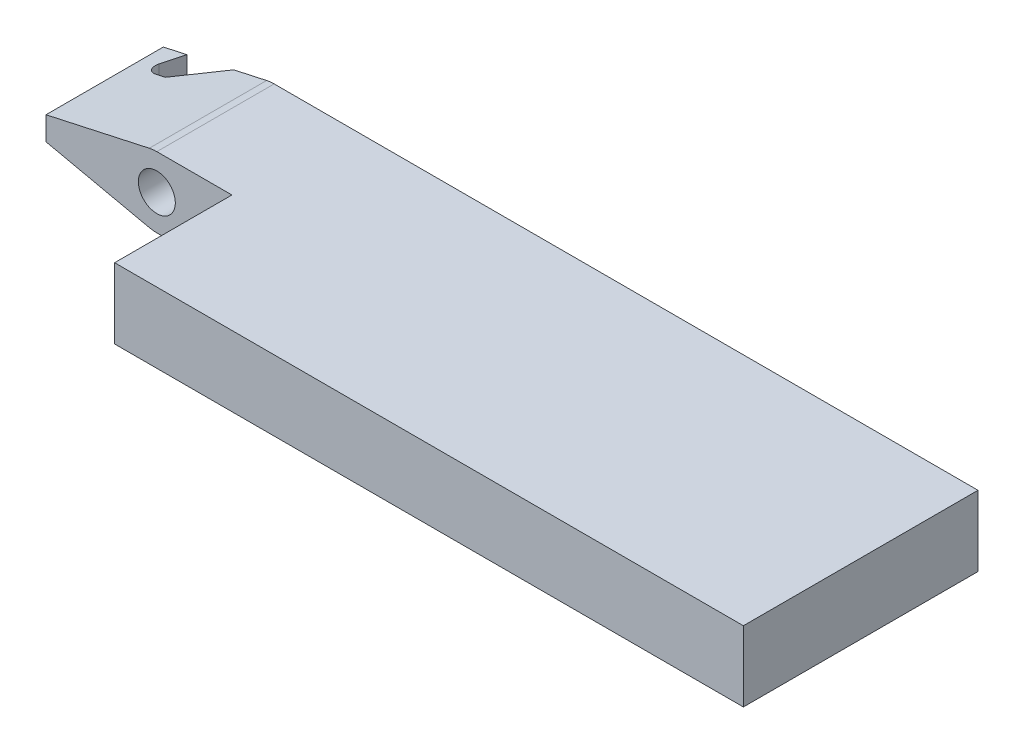
ISO-10303-21;
HEADER;
FILE_DESCRIPTION(('STEP AP214'),'2;1');
FILE_NAME('part.step','',(''),(''),'','','');
FILE_SCHEMA(('AUTOMOTIVE_DESIGN { 1 0 10303 214 1 1 1 1 }'));
ENDSEC;
DATA;
#1=APPLICATION_CONTEXT('core data for automotive mechanical design processes');
#2=APPLICATION_PROTOCOL_DEFINITION('international standard','automotive_design',2000,#1);
#3=PRODUCT_CONTEXT('',#1,'mechanical');
#4=PRODUCT('Part','Part','',(#3));
#5=PRODUCT_RELATED_PRODUCT_CATEGORY('part','',(#4));
#6=PRODUCT_DEFINITION_FORMATION('','',#4);
#7=PRODUCT_DEFINITION_CONTEXT('part definition',#1,'design');
#8=PRODUCT_DEFINITION('design','',#6,#7);
#9=PRODUCT_DEFINITION_SHAPE('','',#8);
#10=(LENGTH_UNIT() NAMED_UNIT(*) SI_UNIT(.MILLI.,.METRE.));
#11=(NAMED_UNIT(*) PLANE_ANGLE_UNIT() SI_UNIT($,.RADIAN.));
#12=(NAMED_UNIT(*) SI_UNIT($,.STERADIAN.) SOLID_ANGLE_UNIT());
#13=UNCERTAINTY_MEASURE_WITH_UNIT(LENGTH_MEASURE(1.E-05),#10,'distance_accuracy_value','');
#14=(GEOMETRIC_REPRESENTATION_CONTEXT(3) GLOBAL_UNCERTAINTY_ASSIGNED_CONTEXT((#13)) GLOBAL_UNIT_ASSIGNED_CONTEXT((#10,
#11,#12)) REPRESENTATION_CONTEXT('',''));
#15=CARTESIAN_POINT('',(0.,0.,0.));
#16=DIRECTION('',(0.,0.,1.));
#17=DIRECTION('',(1.,0.,0.));
#18=AXIS2_PLACEMENT_3D('',#15,#16,#17);
#19=CARTESIAN_POINT('',(0.,3.81,-12.7));
#20=DIRECTION('',(0.,0.,1.));
#21=DIRECTION('',(1.,0.,0.));
#22=AXIS2_PLACEMENT_3D('',#19,#20,#21);
#23=PLANE('',#22);
#24=DIRECTION('',(0.976807089673857,0.214121249676183,0.));
#25=VECTOR('',#24,1.);
#26=CARTESIAN_POINT('',(-0.407900980633129,3.7658175058287,-12.7));
#27=LINE('',#26,#25);
#28=CARTESIAN_POINT('',(-6.,2.54,-12.7));
#29=VERTEX_POINT('',#28);
#30=CARTESIAN_POINT('',(-4.73,2.81839067709833,-12.7));
#31=VERTEX_POINT('',#30);
#32=EDGE_CURVE('E168',#29,#31,#27,.T.);
#33=ORIENTED_EDGE('',*,*,#32,.T.);
#34=DIRECTION('',(0.,-1.,0.));
#35=VECTOR('',#34,1.);
#36=CARTESIAN_POINT('',(-4.73,3.81,-12.7));
#37=LINE('',#36,#35);
#38=CARTESIAN_POINT('',(-4.73,0.991609322901672,-12.7));
#39=VERTEX_POINT('',#38);
#40=EDGE_CURVE('E268',#31,#39,#37,.T.);
#41=ORIENTED_EDGE('',*,*,#40,.T.);
#42=DIRECTION('',(-0.976807089673857,0.214121249676183,0.));
#43=VECTOR('',#42,1.);
#44=CARTESIAN_POINT('',(-6.,1.27,-12.7));
#45=LINE('',#44,#43);
#46=CARTESIAN_POINT('',(-6.,1.27,-12.7));
#47=VERTEX_POINT('',#46);
#48=EDGE_CURVE('E248',#39,#47,#45,.T.);
#49=ORIENTED_EDGE('',*,*,#48,.T.);
#50=DIRECTION('',(0.,1.,0.));
#51=VECTOR('',#50,1.);
#52=CARTESIAN_POINT('',(-6.,2.54,-12.7));
#53=LINE('',#52,#51);
#54=EDGE_CURVE('E169',#47,#29,#53,.T.);
#55=ORIENTED_EDGE('',*,*,#54,.T.);
#56=EDGE_LOOP('',(#33,#41,#49,#55));
#57=FACE_BOUND('',#56,.T.);
#58=ADVANCED_FACE('F34',(#57),#23,.F.);
#59=CARTESIAN_POINT('',(0.,3.81,0.));
#60=DIRECTION('',(0.,0.,-1.));
#61=DIRECTION('',(-1.,0.,0.));
#62=AXIS2_PLACEMENT_3D('',#59,#60,#61);
#63=PLANE('',#62);
#64=DIRECTION('',(1.,0.,0.));
#65=VECTOR('',#64,1.);
#66=CARTESIAN_POINT('',(0.,3.81,0.));
#67=LINE('',#66,#65);
#68=CARTESIAN_POINT('',(4.064,3.81,0.));
#69=VERTEX_POINT('',#68);
#70=CARTESIAN_POINT('',(38.1,3.81,0.));
#71=VERTEX_POINT('',#70);
#72=EDGE_CURVE('E209',#69,#71,#67,.T.);
#73=ORIENTED_EDGE('',*,*,#72,.F.);
#74=DIRECTION('',(0.,1.,0.));
#75=VECTOR('',#74,1.);
#76=CARTESIAN_POINT('',(4.064,0.,0.));
#77=LINE('',#76,#75);
#78=CARTESIAN_POINT('',(4.064,0.,0.));
#79=VERTEX_POINT('',#78);
#80=EDGE_CURVE('E197',#79,#69,#77,.T.);
#81=ORIENTED_EDGE('',*,*,#80,.F.);
#82=DIRECTION('',(1.,0.,0.));
#83=VECTOR('',#82,1.);
#84=CARTESIAN_POINT('',(0.,0.,0.));
#85=LINE('',#84,#83);
#86=CARTESIAN_POINT('',(38.1,0.,0.));
#87=VERTEX_POINT('',#86);
#88=EDGE_CURVE('E220',#79,#87,#85,.T.);
#89=ORIENTED_EDGE('',*,*,#88,.T.);
#90=DIRECTION('',(0.,-1.,0.));
#91=VECTOR('',#90,1.);
#92=CARTESIAN_POINT('',(38.1,3.81,0.));
#93=LINE('',#92,#91);
#94=EDGE_CURVE('E227',#71,#87,#93,.T.);
#95=ORIENTED_EDGE('',*,*,#94,.F.);
#96=EDGE_LOOP('',(#73,#81,#89,#95));
#97=FACE_BOUND('',#96,.T.);
#98=ADVANCED_FACE('F283',(#97),#63,.F.);
#99=CARTESIAN_POINT('',(38.1,3.81,0.));
#100=DIRECTION('',(-1.,0.,0.));
#101=DIRECTION('',(0.,0.,1.));
#102=AXIS2_PLACEMENT_3D('',#99,#100,#101);
#103=PLANE('',#102);
#104=DIRECTION('',(0.,0.,-1.));
#105=VECTOR('',#104,1.);
#106=CARTESIAN_POINT('',(38.1,0.,0.));
#107=LINE('',#106,#105);
#108=CARTESIAN_POINT('',(38.1,0.,-12.7));
#109=VERTEX_POINT('',#108);
#110=EDGE_CURVE('E222',#87,#109,#107,.T.);
#111=ORIENTED_EDGE('',*,*,#110,.T.);
#112=DIRECTION('',(0.,-1.,0.));
#113=VECTOR('',#112,1.);
#114=CARTESIAN_POINT('',(38.1,3.81,-12.7));
#115=LINE('',#114,#113);
#116=CARTESIAN_POINT('',(38.1,3.81,-12.7));
#117=VERTEX_POINT('',#116);
#118=EDGE_CURVE('E217',#117,#109,#115,.T.);
#119=ORIENTED_EDGE('',*,*,#118,.F.);
#120=DIRECTION('',(0.,0.,-1.));
#121=VECTOR('',#120,1.);
#122=CARTESIAN_POINT('',(38.1,3.81,0.));
#123=LINE('',#122,#121);
#124=EDGE_CURVE('E212',#71,#117,#123,.T.);
#125=ORIENTED_EDGE('',*,*,#124,.F.);
#126=ORIENTED_EDGE('',*,*,#94,.T.);
#127=EDGE_LOOP('',(#111,#119,#125,#126));
#128=FACE_BOUND('',#127,.T.);
#129=ADVANCED_FACE('F288',(#128),#103,.F.);
#130=CARTESIAN_POINT('',(-0.407900980633129,0.0441824941713048,-12.7));
#131=VERTEX_POINT('',#130);
#132=CARTESIAN_POINT('',(-2.19,0.434827968705013,-12.7));
#133=VERTEX_POINT('',#132);
#134=EDGE_CURVE('E160',#131,#133,#45,.T.);
#135=ORIENTED_EDGE('',*,*,#134,.T.);
#136=DIRECTION('',(0.,-1.,0.));
#137=VECTOR('',#136,1.);
#138=CARTESIAN_POINT('',(-2.19,3.81,-12.7));
#139=LINE('',#138,#137);
#140=CARTESIAN_POINT('',(-2.19,3.37517203129499,-12.7));
#141=VERTEX_POINT('',#140);
#142=EDGE_CURVE('E143',#141,#133,#139,.T.);
#143=ORIENTED_EDGE('',*,*,#142,.F.);
#144=CARTESIAN_POINT('',(-0.407900980633129,3.7658175058287,-12.7));
#145=VERTEX_POINT('',#144);
#146=EDGE_CURVE('E157',#141,#145,#27,.T.);
#147=ORIENTED_EDGE('',*,*,#146,.T.);
#148=CARTESIAN_POINT('',(0.,1.905,-12.7));
#149=DIRECTION('',(0.,0.,-1.));
#150=DIRECTION('',(-1.,0.,0.));
#151=AXIS2_PLACEMENT_3D('',#148,#149,#150);
#152=CIRCLE('',#151,1.905);
#153=CARTESIAN_POINT('',(0.,3.81,-12.7));
#154=VERTEX_POINT('',#153);
#155=EDGE_CURVE('E252',#145,#154,#152,.T.);
#156=ORIENTED_EDGE('',*,*,#155,.T.);
#157=DIRECTION('',(-1.,0.,0.));
#158=VECTOR('',#157,1.);
#159=CARTESIAN_POINT('',(0.,3.81,-12.7));
#160=LINE('',#159,#158);
#161=EDGE_CURVE('E214',#117,#154,#160,.T.);
#162=ORIENTED_EDGE('',*,*,#161,.F.);
#163=ORIENTED_EDGE('',*,*,#118,.T.);
#164=DIRECTION('',(-1.,0.,0.));
#165=VECTOR('',#164,1.);
#166=CARTESIAN_POINT('',(0.,0.,-12.7));
#167=LINE('',#166,#165);
#168=CARTESIAN_POINT('',(0.,0.,-12.7));
#169=VERTEX_POINT('',#168);
#170=EDGE_CURVE('E210',#109,#169,#167,.T.);
#171=ORIENTED_EDGE('',*,*,#170,.T.);
#172=EDGE_CURVE('E249',#169,#131,#152,.T.);
#173=ORIENTED_EDGE('',*,*,#172,.T.);
#174=EDGE_LOOP('',(#135,#143,#147,#156,#162,#163,#171,#173));
#175=FACE_BOUND('',#174,.T.);
#176=CARTESIAN_POINT('',(0.,1.905,-12.7));
#177=DIRECTION('',(0.,0.,-1.));
#178=DIRECTION('',(-1.,0.,0.));
#179=AXIS2_PLACEMENT_3D('',#176,#177,#178);
#180=CIRCLE('',#179,1.);
#181=CARTESIAN_POINT('',(-1.,1.905,-12.7));
#182=VERTEX_POINT('',#181);
#183=EDGE_CURVE('E186',#182,#182,#180,.T.);
#184=ORIENTED_EDGE('',*,*,#183,.F.);
#185=EDGE_LOOP('',(#184));
#186=FACE_BOUND('',#185,.T.);
#187=ADVANCED_FACE('F154',(#175,#186),#23,.F.);
#188=CARTESIAN_POINT('',(0.,3.81,0.));
#189=DIRECTION('',(0.,-1.,0.));
#190=DIRECTION('',(0.,0.,-1.));
#191=AXIS2_PLACEMENT_3D('',#188,#189,#190);
#192=PLANE('',#191);
#193=DIRECTION('',(0.,0.,1.));
#194=VECTOR('',#193,1.);
#195=CARTESIAN_POINT('',(0.,3.81,0.));
#196=LINE('',#195,#194);
#197=CARTESIAN_POINT('',(0.,3.81,-6.35));
#198=VERTEX_POINT('',#197);
#199=EDGE_CURVE('E206',#154,#198,#196,.T.);
#200=ORIENTED_EDGE('',*,*,#199,.T.);
#201=DIRECTION('',(-1.,0.,0.));
#202=VECTOR('',#201,1.);
#203=CARTESIAN_POINT('',(0.,3.81,-6.35));
#204=LINE('',#203,#202);
#205=CARTESIAN_POINT('',(4.064,3.81,-6.35));
#206=VERTEX_POINT('',#205);
#207=EDGE_CURVE('E195',#206,#198,#204,.T.);
#208=ORIENTED_EDGE('',*,*,#207,.F.);
#209=DIRECTION('',(0.,0.,-1.));
#210=VECTOR('',#209,1.);
#211=CARTESIAN_POINT('',(4.064,3.81,0.));
#212=LINE('',#211,#210);
#213=EDGE_CURVE('E189',#69,#206,#212,.T.);
#214=ORIENTED_EDGE('',*,*,#213,.F.);
#215=ORIENTED_EDGE('',*,*,#72,.T.);
#216=ORIENTED_EDGE('',*,*,#124,.T.);
#217=ORIENTED_EDGE('',*,*,#161,.T.);
#218=EDGE_LOOP('',(#200,#208,#214,#215,#216,#217));
#219=FACE_BOUND('',#218,.T.);
#220=ADVANCED_FACE('F293',(#219),#192,.F.);
#221=CARTESIAN_POINT('',(0.,0.,0.));
#222=DIRECTION('',(0.,-1.,0.));
#223=DIRECTION('',(0.,0.,-1.));
#224=AXIS2_PLACEMENT_3D('',#221,#222,#223);
#225=PLANE('',#224);
#226=DIRECTION('',(-1.,0.,0.));
#227=VECTOR('',#226,1.);
#228=CARTESIAN_POINT('',(0.,0.,-6.35));
#229=LINE('',#228,#227);
#230=CARTESIAN_POINT('',(4.064,0.,-6.35));
#231=VERTEX_POINT('',#230);
#232=CARTESIAN_POINT('',(0.,0.,-6.35));
#233=VERTEX_POINT('',#232);
#234=EDGE_CURVE('E194',#231,#233,#229,.T.);
#235=ORIENTED_EDGE('',*,*,#234,.T.);
#236=DIRECTION('',(0.,0.,1.));
#237=VECTOR('',#236,1.);
#238=CARTESIAN_POINT('',(0.,0.,0.));
#239=LINE('',#238,#237);
#240=EDGE_CURVE('E204',#169,#233,#239,.T.);
#241=ORIENTED_EDGE('',*,*,#240,.F.);
#242=ORIENTED_EDGE('',*,*,#170,.F.);
#243=ORIENTED_EDGE('',*,*,#110,.F.);
#244=ORIENTED_EDGE('',*,*,#88,.F.);
#245=DIRECTION('',(0.,0.,-1.));
#246=VECTOR('',#245,1.);
#247=CARTESIAN_POINT('',(4.064,0.,0.));
#248=LINE('',#247,#246);
#249=EDGE_CURVE('E191',#79,#231,#248,.T.);
#250=ORIENTED_EDGE('',*,*,#249,.T.);
#251=EDGE_LOOP('',(#235,#241,#242,#243,#244,#250));
#252=FACE_BOUND('',#251,.T.);
#253=ADVANCED_FACE('F298',(#252),#225,.T.);
#254=CARTESIAN_POINT('',(0.,0.,-6.35));
#255=DIRECTION('',(0.,0.,-1.));
#256=DIRECTION('',(-1.,0.,0.));
#257=AXIS2_PLACEMENT_3D('',#254,#255,#256);
#258=PLANE('',#257);
#259=CARTESIAN_POINT('',(0.,1.905,-6.35));
#260=DIRECTION('',(0.,0.,-1.));
#261=DIRECTION('',(-1.,0.,0.));
#262=AXIS2_PLACEMENT_3D('',#259,#260,#261);
#263=CIRCLE('',#262,1.);
#264=CARTESIAN_POINT('',(-1.,1.905,-6.35));
#265=VERTEX_POINT('',#264);
#266=EDGE_CURVE('E150',#265,#265,#263,.T.);
#267=ORIENTED_EDGE('',*,*,#266,.T.);
#268=EDGE_LOOP('',(#267));
#269=FACE_BOUND('',#268,.T.);
#270=ORIENTED_EDGE('',*,*,#207,.T.);
#271=CARTESIAN_POINT('',(0.,1.905,-6.35));
#272=DIRECTION('',(0.,0.,-1.));
#273=DIRECTION('',(-1.,0.,0.));
#274=AXIS2_PLACEMENT_3D('',#271,#272,#273);
#275=CIRCLE('',#274,1.905);
#276=CARTESIAN_POINT('',(-0.407900980633129,3.7658175058287,-6.35));
#277=VERTEX_POINT('',#276);
#278=EDGE_CURVE('E263',#198,#277,#275,.F.);
#279=ORIENTED_EDGE('',*,*,#278,.T.);
#280=DIRECTION('',(-0.976807089673857,-0.214121249676183,0.));
#281=VECTOR('',#280,1.);
#282=CARTESIAN_POINT('',(-0.407900980633129,3.7658175058287,-6.35));
#283=LINE('',#282,#281);
#284=CARTESIAN_POINT('',(-6.,2.54,-6.35));
#285=VERTEX_POINT('',#284);
#286=EDGE_CURVE('E261',#277,#285,#283,.T.);
#287=ORIENTED_EDGE('',*,*,#286,.T.);
#288=DIRECTION('',(0.,-1.,0.));
#289=VECTOR('',#288,1.);
#290=CARTESIAN_POINT('',(-6.,2.54,-6.35));
#291=LINE('',#290,#289);
#292=CARTESIAN_POINT('',(-6.,1.27,-6.35));
#293=VERTEX_POINT('',#292);
#294=EDGE_CURVE('E178',#285,#293,#291,.T.);
#295=ORIENTED_EDGE('',*,*,#294,.T.);
#296=DIRECTION('',(0.976807089673857,-0.214121249676183,0.));
#297=VECTOR('',#296,1.);
#298=CARTESIAN_POINT('',(-6.,1.27,-6.35));
#299=LINE('',#298,#297);
#300=CARTESIAN_POINT('',(-0.407900980633129,0.0441824941713048,-6.35));
#301=VERTEX_POINT('',#300);
#302=EDGE_CURVE('E190',#293,#301,#299,.T.);
#303=ORIENTED_EDGE('',*,*,#302,.T.);
#304=EDGE_CURVE('E259',#301,#233,#275,.F.);
#305=ORIENTED_EDGE('',*,*,#304,.T.);
#306=ORIENTED_EDGE('',*,*,#234,.F.);
#307=DIRECTION('',(0.,1.,0.));
#308=VECTOR('',#307,1.);
#309=CARTESIAN_POINT('',(4.064,0.,-6.35));
#310=LINE('',#309,#308);
#311=EDGE_CURVE('E202',#231,#206,#310,.T.);
#312=ORIENTED_EDGE('',*,*,#311,.T.);
#313=EDGE_LOOP('',(#270,#279,#287,#295,#303,#305,#306,#312));
#314=FACE_BOUND('',#313,.T.);
#315=ADVANCED_FACE('F341',(#269,#314),#258,.F.);
#316=CARTESIAN_POINT('',(4.064,0.,0.));
#317=DIRECTION('',(1.,0.,0.));
#318=DIRECTION('',(0.,0.,-1.));
#319=AXIS2_PLACEMENT_3D('',#316,#317,#318);
#320=PLANE('',#319);
#321=ORIENTED_EDGE('',*,*,#213,.T.);
#322=ORIENTED_EDGE('',*,*,#311,.F.);
#323=ORIENTED_EDGE('',*,*,#249,.F.);
#324=ORIENTED_EDGE('',*,*,#80,.T.);
#325=EDGE_LOOP('',(#321,#322,#323,#324));
#326=FACE_BOUND('',#325,.T.);
#327=ADVANCED_FACE('F339',(#326),#320,.F.);
#328=CARTESIAN_POINT('',(0.,1.905,0.));
#329=DIRECTION('',(0.,0.,-1.));
#330=DIRECTION('',(-1.,0.,0.));
#331=AXIS2_PLACEMENT_3D('',#328,#329,#330);
#332=CYLINDRICAL_SURFACE('',#331,1.);
#333=ORIENTED_EDGE('',*,*,#183,.T.);
#334=EDGE_LOOP('',(#333));
#335=FACE_BOUND('',#334,.T.);
#336=ORIENTED_EDGE('',*,*,#266,.F.);
#337=EDGE_LOOP('',(#336));
#338=FACE_BOUND('',#337,.T.);
#339=ADVANCED_FACE('F336',(#335,#338),#332,.F.);
#340=CARTESIAN_POINT('',(0.,1.905,2.42525640651029));
#341=DIRECTION('',(0.,0.,-1.));
#342=DIRECTION('',(-1.,0.,0.));
#343=AXIS2_PLACEMENT_3D('',#340,#341,#342);
#344=CYLINDRICAL_SURFACE('',#343,1.905);
#345=ORIENTED_EDGE('',*,*,#240,.T.);
#346=ORIENTED_EDGE('',*,*,#304,.F.);
#347=DIRECTION('',(0.,0.,-1.));
#348=VECTOR('',#347,1.);
#349=CARTESIAN_POINT('',(-0.407900980633129,0.0441824941713048,2.42525640651029));
#350=LINE('',#349,#348);
#351=EDGE_CURVE('E172',#301,#131,#350,.T.);
#352=ORIENTED_EDGE('',*,*,#351,.T.);
#353=ORIENTED_EDGE('',*,*,#172,.F.);
#354=EDGE_LOOP('',(#345,#346,#352,#353));
#355=FACE_BOUND('',#354,.T.);
#356=ADVANCED_FACE('F316',(#355),#344,.T.);
#357=CARTESIAN_POINT('',(-6.,1.27,2.42525640651029));
#358=DIRECTION('',(-0.214121249676183,-0.976807089673857,0.));
#359=DIRECTION('',(0.976807089673857,-0.214121249676183,0.));
#360=AXIS2_PLACEMENT_3D('',#357,#358,#359);
#361=PLANE('',#360);
#362=DIRECTION('',(0.341062947383633,-0.0747627912246309,-0.937062746549179));
#363=VECTOR('',#362,1.);
#364=CARTESIAN_POINT('',(-9.71882238241687,2.08518541814917,1.00667684536027));
#365=LINE('',#364,#363);
#366=CARTESIAN_POINT('',(-5.12900374045955,1.07907304059561,-11.6037462328094));
#367=VERTEX_POINT('',#366);
#368=EDGE_CURVE('E242',#367,#39,#365,.T.);
#369=ORIENTED_EDGE('',*,*,#368,.F.);
#370=CARTESIAN_POINT('',(-4.65163988910031,0.974432374609652,-11.43));
#371=DIRECTION('',(-0.214121249676183,-0.976807089673857,0.));
#372=DIRECTION('',(-0.976807089673857,0.214121249676183,0.));
#373=AXIS2_PLACEMENT_3D('',#370,#371,#372);
#374=ELLIPSE('',#373,0.520061745425716,0.508);
#375=CARTESIAN_POINT('',(-4.65163988910031,0.974432374609652,-10.922));
#376=VERTEX_POINT('',#375);
#377=EDGE_CURVE('E42',#367,#376,#374,.F.);
#378=ORIENTED_EDGE('',*,*,#377,.T.);
#379=DIRECTION('',(-0.976807089673857,0.214121249676183,0.));
#380=VECTOR('',#379,1.);
#381=CARTESIAN_POINT('',(-6.,1.27,-10.922));
#382=LINE('',#381,#380);
#383=CARTESIAN_POINT('',(-4.1071390765253,0.855074933748749,-10.922));
#384=VERTEX_POINT('',#383);
#385=EDGE_CURVE('E250',#384,#376,#382,.T.);
#386=ORIENTED_EDGE('',*,*,#385,.F.);
#387=DIRECTION('',(-0.723922350531886,0.158687585300146,0.671382663368662));
#388=VECTOR('',#387,1.);
#389=CARTESIAN_POINT('',(-11.6339366386724,2.50498853194417,-3.94147040287094));
#390=LINE('',#389,#388);
#391=EDGE_CURVE('E254',#133,#384,#390,.T.);
#392=ORIENTED_EDGE('',*,*,#391,.F.);
#393=ORIENTED_EDGE('',*,*,#134,.F.);
#394=ORIENTED_EDGE('',*,*,#351,.F.);
#395=ORIENTED_EDGE('',*,*,#302,.F.);
#396=DIRECTION('',(0.,0.,-1.));
#397=VECTOR('',#396,1.);
#398=CARTESIAN_POINT('',(-6.,1.27,2.42525640651029));
#399=LINE('',#398,#397);
#400=EDGE_CURVE('E181',#293,#47,#399,.T.);
#401=ORIENTED_EDGE('',*,*,#400,.T.);
#402=ORIENTED_EDGE('',*,*,#48,.F.);
#403=EDGE_LOOP('',(#369,#378,#386,#392,#393,#394,#395,#401,#402));
#404=FACE_BOUND('',#403,.T.);
#405=ADVANCED_FACE('F247',(#404),#361,.T.);
#406=CARTESIAN_POINT('',(-6.,2.54,2.42525640651029));
#407=DIRECTION('',(-1.,0.,0.));
#408=DIRECTION('',(0.,0.,1.));
#409=AXIS2_PLACEMENT_3D('',#406,#407,#408);
#410=PLANE('',#409);
#411=ORIENTED_EDGE('',*,*,#294,.F.);
#412=DIRECTION('',(0.,0.,-1.));
#413=VECTOR('',#412,1.);
#414=CARTESIAN_POINT('',(-6.,2.54,2.42525640651029));
#415=LINE('',#414,#413);
#416=EDGE_CURVE('E179',#285,#29,#415,.T.);
#417=ORIENTED_EDGE('',*,*,#416,.T.);
#418=ORIENTED_EDGE('',*,*,#54,.F.);
#419=ORIENTED_EDGE('',*,*,#400,.F.);
#420=EDGE_LOOP('',(#411,#417,#418,#419));
#421=FACE_BOUND('',#420,.T.);
#422=ADVANCED_FACE('F274',(#421),#410,.T.);
#423=CARTESIAN_POINT('',(-0.407900980633129,3.7658175058287,2.42525640651029));
#424=DIRECTION('',(-0.214121249676183,0.976807089673857,0.));
#425=DIRECTION('',(-0.976807089673857,-0.214121249676183,0.));
#426=AXIS2_PLACEMENT_3D('',#423,#424,#425);
#427=PLANE('',#426);
#428=DIRECTION('',(-0.341062947383633,-0.0747627912246309,0.937062746549179));
#429=VECTOR('',#428,1.);
#430=CARTESIAN_POINT('',(-9.03707052733416,1.8742581728347,-0.86642098215078));
#431=LINE('',#430,#429);
#432=CARTESIAN_POINT('',(-5.12900374045955,2.73092695940439,-11.6037462328094));
#433=VERTEX_POINT('',#432);
#434=EDGE_CURVE('E233',#31,#433,#431,.T.);
#435=ORIENTED_EDGE('',*,*,#434,.F.);
#436=ORIENTED_EDGE('',*,*,#32,.F.);
#437=ORIENTED_EDGE('',*,*,#416,.F.);
#438=ORIENTED_EDGE('',*,*,#286,.F.);
#439=DIRECTION('',(0.,0.,-1.));
#440=VECTOR('',#439,1.);
#441=CARTESIAN_POINT('',(-0.407900980633129,3.7658175058287,2.42525640651029));
#442=LINE('',#441,#440);
#443=EDGE_CURVE('E166',#277,#145,#442,.T.);
#444=ORIENTED_EDGE('',*,*,#443,.T.);
#445=ORIENTED_EDGE('',*,*,#146,.F.);
#446=DIRECTION('',(0.723922350531886,0.158687585300146,-0.671382663368662));
#447=VECTOR('',#446,1.);
#448=CARTESIAN_POINT('',(-8.56250242706644,1.97828599548257,-6.78999093802854));
#449=LINE('',#448,#447);
#450=CARTESIAN_POINT('',(-4.1071390765253,2.95492506625125,-10.922));
#451=VERTEX_POINT('',#450);
#452=EDGE_CURVE('E140',#451,#141,#449,.T.);
#453=ORIENTED_EDGE('',*,*,#452,.F.);
#454=DIRECTION('',(0.976807089673857,0.214121249676183,0.));
#455=VECTOR('',#454,1.);
#456=CARTESIAN_POINT('',(-0.407900980633129,3.7658175058287,-10.922));
#457=LINE('',#456,#455);
#458=CARTESIAN_POINT('',(-4.65163988910031,2.83556762539035,-10.922));
#459=VERTEX_POINT('',#458);
#460=EDGE_CURVE('E149',#459,#451,#457,.T.);
#461=ORIENTED_EDGE('',*,*,#460,.F.);
#462=CARTESIAN_POINT('',(-4.65163988910031,2.83556762539035,-11.43));
#463=DIRECTION('',(-0.214121249676183,0.976807089673857,0.));
#464=DIRECTION('',(0.976807089673857,0.214121249676183,0.));
#465=AXIS2_PLACEMENT_3D('',#462,#463,#464);
#466=ELLIPSE('',#465,0.520061745425716,0.508);
#467=EDGE_CURVE('E11',#459,#433,#466,.F.);
#468=ORIENTED_EDGE('',*,*,#467,.T.);
#469=EDGE_LOOP('',(#435,#436,#437,#438,#444,#445,#453,#461,#468));
#470=FACE_BOUND('',#469,.T.);
#471=ADVANCED_FACE('F163',(#470),#427,.T.);
#472=ORIENTED_EDGE('',*,*,#278,.F.);
#473=ORIENTED_EDGE('',*,*,#199,.F.);
#474=ORIENTED_EDGE('',*,*,#155,.F.);
#475=ORIENTED_EDGE('',*,*,#443,.F.);
#476=EDGE_LOOP('',(#472,#473,#474,#475));
#477=FACE_BOUND('',#476,.T.);
#478=ADVANCED_FACE('F324',(#477),#344,.T.);
#479=CARTESIAN_POINT('',(-4.73,3.81,-12.7));
#480=DIRECTION('',(-0.939692620785909,0.,-0.342020143325666));
#481=DIRECTION('',(-0.342020143325666,0.,0.939692620785909));
#482=AXIS2_PLACEMENT_3D('',#479,#480,#481);
#483=PLANE('',#482);
#484=ORIENTED_EDGE('',*,*,#434,.T.);
#485=DIRECTION('',(0.,-1.,0.));
#486=VECTOR('',#485,1.);
#487=CARTESIAN_POINT('',(-5.12900374045955,1.13346561084708,-11.6037462328094));
#488=LINE('',#487,#486);
#489=EDGE_CURVE('E236',#433,#367,#488,.T.);
#490=ORIENTED_EDGE('',*,*,#489,.T.);
#491=ORIENTED_EDGE('',*,*,#368,.T.);
#492=ORIENTED_EDGE('',*,*,#40,.F.);
#493=EDGE_LOOP('',(#484,#490,#491,#492));
#494=FACE_BOUND('',#493,.T.);
#495=ADVANCED_FACE('F241',(#494),#483,.F.);
#496=CARTESIAN_POINT('',(-5.3771390765253,3.81,-10.922));
#497=DIRECTION('',(0.,0.,1.));
#498=DIRECTION('',(1.,0.,0.));
#499=AXIS2_PLACEMENT_3D('',#496,#497,#498);
#500=PLANE('',#499);
#501=ORIENTED_EDGE('',*,*,#385,.T.);
#502=DIRECTION('',(0.,-1.,0.));
#503=VECTOR('',#502,1.);
#504=CARTESIAN_POINT('',(-4.65163988910031,2.67653438915292,-10.922));
#505=LINE('',#504,#503);
#506=EDGE_CURVE('E49',#376,#459,#505,.F.);
#507=ORIENTED_EDGE('',*,*,#506,.T.);
#508=ORIENTED_EDGE('',*,*,#460,.T.);
#509=DIRECTION('',(0.,-1.,0.));
#510=VECTOR('',#509,1.);
#511=CARTESIAN_POINT('',(-4.1071390765253,3.81,-10.922));
#512=LINE('',#511,#510);
#513=EDGE_CURVE('E146',#451,#384,#512,.T.);
#514=ORIENTED_EDGE('',*,*,#513,.T.);
#515=EDGE_LOOP('',(#501,#507,#508,#514));
#516=FACE_BOUND('',#515,.T.);
#517=ADVANCED_FACE('F280',(#516),#500,.F.);
#518=CARTESIAN_POINT('',(-4.1071390765253,3.81,-10.922));
#519=DIRECTION('',(0.679999035827433,0.,0.733213005390495));
#520=DIRECTION('',(0.733213005390495,0.,-0.679999035827433));
#521=AXIS2_PLACEMENT_3D('',#518,#519,#520);
#522=PLANE('',#521);
#523=ORIENTED_EDGE('',*,*,#391,.T.);
#524=ORIENTED_EDGE('',*,*,#513,.F.);
#525=ORIENTED_EDGE('',*,*,#452,.T.);
#526=ORIENTED_EDGE('',*,*,#142,.T.);
#527=EDGE_LOOP('',(#523,#524,#525,#526));
#528=FACE_BOUND('',#527,.T.);
#529=ADVANCED_FACE('F142',(#528),#522,.F.);
#530=CARTESIAN_POINT('',(-4.65163988910031,3.81,-11.43));
#531=DIRECTION('',(0.,1.,0.));
#532=DIRECTION('',(0.,0.,1.));
#533=AXIS2_PLACEMENT_3D('',#530,#531,#532);
#534=CYLINDRICAL_SURFACE('',#533,0.508);
#535=ORIENTED_EDGE('',*,*,#467,.F.);
#536=ORIENTED_EDGE('',*,*,#506,.F.);
#537=ORIENTED_EDGE('',*,*,#377,.F.);
#538=ORIENTED_EDGE('',*,*,#489,.F.);
#539=EDGE_LOOP('',(#535,#536,#537,#538));
#540=FACE_BOUND('',#539,.T.);
#541=ADVANCED_FACE('F36',(#540),#534,.F.);
#542=CLOSED_SHELL('',(#58,#98,#129,#187,#220,#253,#315,#327,#339,#356,#405,#422,#471,#478,#495,
#517,#529,#541));
#543=MANIFOLD_SOLID_BREP('B2',#542);
#544=ADVANCED_BREP_SHAPE_REPRESENTATION('',(#18,#543),#14);
#545=SHAPE_DEFINITION_REPRESENTATION(#9,#544);
ENDSEC;
END-ISO-10303-21;
